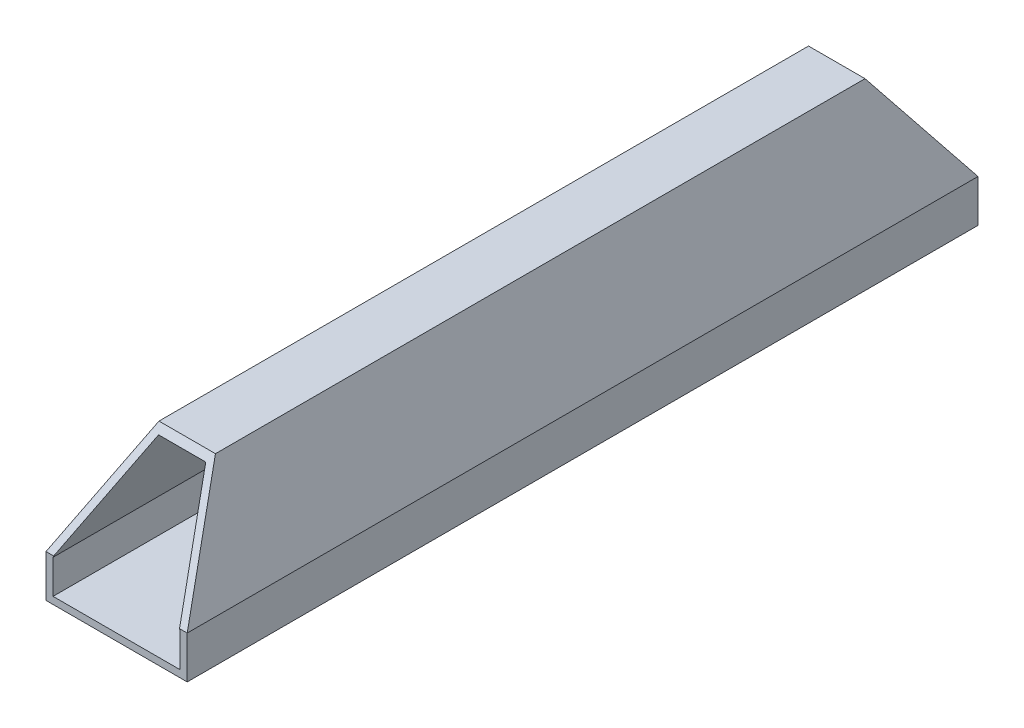
ISO-10303-21;
HEADER;
FILE_DESCRIPTION(('STEP AP214'),'2;1');
FILE_NAME('part.step','',(''),(''),'','','');
FILE_SCHEMA(('AUTOMOTIVE_DESIGN { 1 0 10303 214 1 1 1 1 }'));
ENDSEC;
DATA;
#1=APPLICATION_CONTEXT('core data for automotive mechanical design processes');
#2=APPLICATION_PROTOCOL_DEFINITION('international standard','automotive_design',2000,#1);
#3=PRODUCT_CONTEXT('',#1,'mechanical');
#4=PRODUCT('Part','Part','',(#3));
#5=PRODUCT_RELATED_PRODUCT_CATEGORY('part','',(#4));
#6=PRODUCT_DEFINITION_FORMATION('','',#4);
#7=PRODUCT_DEFINITION_CONTEXT('part definition',#1,'design');
#8=PRODUCT_DEFINITION('design','',#6,#7);
#9=PRODUCT_DEFINITION_SHAPE('','',#8);
#10=(LENGTH_UNIT() NAMED_UNIT(*) SI_UNIT(.MILLI.,.METRE.));
#11=(NAMED_UNIT(*) PLANE_ANGLE_UNIT() SI_UNIT($,.RADIAN.));
#12=(NAMED_UNIT(*) SI_UNIT($,.STERADIAN.) SOLID_ANGLE_UNIT());
#13=UNCERTAINTY_MEASURE_WITH_UNIT(LENGTH_MEASURE(1.E-05),#10,'distance_accuracy_value','');
#14=(GEOMETRIC_REPRESENTATION_CONTEXT(3) GLOBAL_UNCERTAINTY_ASSIGNED_CONTEXT((#13)) GLOBAL_UNIT_ASSIGNED_CONTEXT((#10,
#11,#12)) REPRESENTATION_CONTEXT('',''));
#15=CARTESIAN_POINT('',(0.,0.,0.));
#16=DIRECTION('',(0.,0.,1.));
#17=DIRECTION('',(1.,0.,0.));
#18=AXIS2_PLACEMENT_3D('',#15,#16,#17);
#19=CARTESIAN_POINT('',(-10.,0.,112.));
#20=DIRECTION('',(0.919145030018058,-0.393919298579168,0.));
#21=DIRECTION('',(0.393919298579168,0.919145030018058,0.));
#22=AXIS2_PLACEMENT_3D('',#19,#20,#21);
#23=PLANE('',#22);
#24=DIRECTION('',(0.,0.,-1.));
#25=VECTOR('',#24,1.);
#26=CARTESIAN_POINT('',(-4.,14.,112.));
#27=LINE('',#26,#25);
#28=CARTESIAN_POINT('',(-4.,14.,102.));
#29=VERTEX_POINT('',#28);
#30=CARTESIAN_POINT('',(-4.,14.,10.));
#31=VERTEX_POINT('',#30);
#32=EDGE_CURVE('E189',#29,#31,#27,.T.);
#33=ORIENTED_EDGE('',*,*,#32,.T.);
#34=DIRECTION('',(-0.329292779969071,-0.768349819927832,-0.548821299948452));
#35=VECTOR('',#34,1.);
#36=CARTESIAN_POINT('',(10.2409638554217,47.2289156626506,33.7349397590361));
#37=LINE('',#36,#35);
#38=CARTESIAN_POINT('',(-10.,0.,0.));
#39=VERTEX_POINT('',#38);
#40=EDGE_CURVE('E150',#31,#39,#37,.T.);
#41=ORIENTED_EDGE('',*,*,#40,.T.);
#42=DIRECTION('',(0.,0.,-1.));
#43=VECTOR('',#42,1.);
#44=CARTESIAN_POINT('',(-10.,0.,112.));
#45=LINE('',#44,#43);
#46=CARTESIAN_POINT('',(-10.,0.,112.));
#47=VERTEX_POINT('',#46);
#48=EDGE_CURVE('E196',#47,#39,#45,.T.);
#49=ORIENTED_EDGE('',*,*,#48,.F.);
#50=DIRECTION('',(0.329292779969071,0.768349819927833,-0.548821299948451));
#51=VECTOR('',#50,1.);
#52=CARTESIAN_POINT('',(-10.,0.,112.));
#53=LINE('',#52,#51);
#54=EDGE_CURVE('E219',#47,#29,#53,.T.);
#55=ORIENTED_EDGE('',*,*,#54,.T.);
#56=EDGE_LOOP('',(#33,#41,#49,#55));
#57=FACE_BOUND('',#56,.T.);
#58=ADVANCED_FACE('F39',(#57),#23,.F.);
#59=CARTESIAN_POINT('',(-10.,-6.00000000000001,112.));
#60=DIRECTION('',(1.,0.,0.));
#61=DIRECTION('',(0.,0.,-1.));
#62=AXIS2_PLACEMENT_3D('',#59,#60,#61);
#63=PLANE('',#62);
#64=DIRECTION('',(0.,-1.,0.));
#65=VECTOR('',#64,1.);
#66=CARTESIAN_POINT('',(-10.,-6.00000000000001,0.));
#67=LINE('',#66,#65);
#68=CARTESIAN_POINT('',(-10.,-6.00000000000001,0.));
#69=VERTEX_POINT('',#68);
#70=EDGE_CURVE('E245',#39,#69,#67,.T.);
#71=ORIENTED_EDGE('',*,*,#70,.T.);
#72=DIRECTION('',(0.,0.,-1.));
#73=VECTOR('',#72,1.);
#74=CARTESIAN_POINT('',(-10.,-6.00000000000001,112.));
#75=LINE('',#74,#73);
#76=CARTESIAN_POINT('',(-10.,-6.00000000000001,112.));
#77=VERTEX_POINT('',#76);
#78=EDGE_CURVE('E187',#77,#69,#75,.T.);
#79=ORIENTED_EDGE('',*,*,#78,.F.);
#80=DIRECTION('',(0.,-1.,0.));
#81=VECTOR('',#80,1.);
#82=CARTESIAN_POINT('',(-10.,-6.00000000000001,112.));
#83=LINE('',#82,#81);
#84=EDGE_CURVE('E175',#47,#77,#83,.T.);
#85=ORIENTED_EDGE('',*,*,#84,.F.);
#86=ORIENTED_EDGE('',*,*,#48,.T.);
#87=EDGE_LOOP('',(#71,#79,#85,#86));
#88=FACE_BOUND('',#87,.T.);
#89=ADVANCED_FACE('F337',(#88),#63,.F.);
#90=CARTESIAN_POINT('',(10.,-6.,112.));
#91=DIRECTION('',(0.,1.,0.));
#92=DIRECTION('',(-1.,0.,0.));
#93=AXIS2_PLACEMENT_3D('',#90,#91,#92);
#94=PLANE('',#93);
#95=DIRECTION('',(1.,0.,0.));
#96=VECTOR('',#95,1.);
#97=CARTESIAN_POINT('',(10.,-6.,0.));
#98=LINE('',#97,#96);
#99=CARTESIAN_POINT('',(10.,-6.,0.));
#100=VERTEX_POINT('',#99);
#101=EDGE_CURVE('E176',#69,#100,#98,.T.);
#102=ORIENTED_EDGE('',*,*,#101,.T.);
#103=DIRECTION('',(0.,0.,-1.));
#104=VECTOR('',#103,1.);
#105=CARTESIAN_POINT('',(10.,-6.,112.));
#106=LINE('',#105,#104);
#107=CARTESIAN_POINT('',(10.,-6.,112.));
#108=VERTEX_POINT('',#107);
#109=EDGE_CURVE('E173',#108,#100,#106,.T.);
#110=ORIENTED_EDGE('',*,*,#109,.F.);
#111=DIRECTION('',(1.,0.,0.));
#112=VECTOR('',#111,1.);
#113=CARTESIAN_POINT('',(10.,-6.,112.));
#114=LINE('',#113,#112);
#115=EDGE_CURVE('E262',#77,#108,#114,.T.);
#116=ORIENTED_EDGE('',*,*,#115,.F.);
#117=ORIENTED_EDGE('',*,*,#78,.T.);
#118=EDGE_LOOP('',(#102,#110,#116,#117));
#119=FACE_BOUND('',#118,.T.);
#120=ADVANCED_FACE('F334',(#119),#94,.F.);
#121=CARTESIAN_POINT('',(10.,0.,112.));
#122=DIRECTION('',(-1.,0.,0.));
#123=DIRECTION('',(0.,-1.,0.));
#124=AXIS2_PLACEMENT_3D('',#121,#122,#123);
#125=PLANE('',#124);
#126=DIRECTION('',(0.,1.,0.));
#127=VECTOR('',#126,1.);
#128=CARTESIAN_POINT('',(10.,0.,0.));
#129=LINE('',#128,#127);
#130=CARTESIAN_POINT('',(10.,0.,0.));
#131=VERTEX_POINT('',#130);
#132=EDGE_CURVE('E159',#100,#131,#129,.T.);
#133=ORIENTED_EDGE('',*,*,#132,.T.);
#134=DIRECTION('',(0.,0.,-1.));
#135=VECTOR('',#134,1.);
#136=CARTESIAN_POINT('',(10.,0.,112.));
#137=LINE('',#136,#135);
#138=CARTESIAN_POINT('',(10.,0.,112.));
#139=VERTEX_POINT('',#138);
#140=EDGE_CURVE('E171',#139,#131,#137,.T.);
#141=ORIENTED_EDGE('',*,*,#140,.F.);
#142=DIRECTION('',(0.,1.,0.));
#143=VECTOR('',#142,1.);
#144=CARTESIAN_POINT('',(10.,0.,112.));
#145=LINE('',#144,#143);
#146=EDGE_CURVE('E265',#108,#139,#145,.T.);
#147=ORIENTED_EDGE('',*,*,#146,.F.);
#148=ORIENTED_EDGE('',*,*,#109,.T.);
#149=EDGE_LOOP('',(#133,#141,#147,#148));
#150=FACE_BOUND('',#149,.T.);
#151=ADVANCED_FACE('F169',(#150),#125,.F.);
#152=CARTESIAN_POINT('',(4.,14.,112.));
#153=DIRECTION('',(-0.919145030018058,-0.393919298579168,0.));
#154=DIRECTION('',(0.393919298579168,-0.919145030018058,0.));
#155=AXIS2_PLACEMENT_3D('',#152,#153,#154);
#156=PLANE('',#155);
#157=ORIENTED_EDGE('',*,*,#140,.T.);
#158=DIRECTION('',(-0.329292779969071,0.768349819927832,0.548821299948452));
#159=VECTOR('',#158,1.);
#160=CARTESIAN_POINT('',(-14.433734939759,57.0120481927711,40.7228915662651));
#161=LINE('',#160,#159);
#162=CARTESIAN_POINT('',(4.,14.,10.));
#163=VERTEX_POINT('',#162);
#164=EDGE_CURVE('E138',#131,#163,#161,.T.);
#165=ORIENTED_EDGE('',*,*,#164,.T.);
#166=DIRECTION('',(0.,0.,-1.));
#167=VECTOR('',#166,1.);
#168=CARTESIAN_POINT('',(4.,14.,112.));
#169=LINE('',#168,#167);
#170=CARTESIAN_POINT('',(4.,14.,102.));
#171=VERTEX_POINT('',#170);
#172=EDGE_CURVE('E183',#171,#163,#169,.T.);
#173=ORIENTED_EDGE('',*,*,#172,.F.);
#174=DIRECTION('',(0.329292779969071,-0.768349819927833,0.548821299948452));
#175=VECTOR('',#174,1.);
#176=CARTESIAN_POINT('',(5.80722891566265,9.78313253012048,105.012048192771));
#177=LINE('',#176,#175);
#178=EDGE_CURVE('E180',#171,#139,#177,.T.);
#179=ORIENTED_EDGE('',*,*,#178,.T.);
#180=EDGE_LOOP('',(#157,#165,#173,#179));
#181=FACE_BOUND('',#180,.T.);
#182=ADVANCED_FACE('F179',(#181),#156,.F.);
#183=CARTESIAN_POINT('',(-4.,14.,112.));
#184=DIRECTION('',(0.,-1.,0.));
#185=DIRECTION('',(1.,0.,0.));
#186=AXIS2_PLACEMENT_3D('',#183,#184,#185);
#187=PLANE('',#186);
#188=ORIENTED_EDGE('',*,*,#172,.T.);
#189=DIRECTION('',(-1.,0.,0.));
#190=VECTOR('',#189,1.);
#191=CARTESIAN_POINT('',(10.,14.,10.));
#192=LINE('',#191,#190);
#193=EDGE_CURVE('E144',#163,#31,#192,.T.);
#194=ORIENTED_EDGE('',*,*,#193,.T.);
#195=ORIENTED_EDGE('',*,*,#32,.F.);
#196=DIRECTION('',(1.,0.,0.));
#197=VECTOR('',#196,1.);
#198=CARTESIAN_POINT('',(-10.,14.,102.));
#199=LINE('',#198,#197);
#200=EDGE_CURVE('E281',#29,#171,#199,.T.);
#201=ORIENTED_EDGE('',*,*,#200,.T.);
#202=EDGE_LOOP('',(#188,#194,#195,#201));
#203=FACE_BOUND('',#202,.T.);
#204=ADVANCED_FACE('F280',(#203),#187,.F.);
#205=CARTESIAN_POINT('',(0.,0.,112.));
#206=DIRECTION('',(0.,0.,-1.));
#207=DIRECTION('',(-1.,0.,0.));
#208=AXIS2_PLACEMENT_3D('',#205,#206,#207);
#209=PLANE('',#208);
#210=ORIENTED_EDGE('',*,*,#146,.T.);
#211=DIRECTION('',(1.,0.,0.));
#212=VECTOR('',#211,1.);
#213=CARTESIAN_POINT('',(-10.,0.,112.));
#214=LINE('',#213,#212);
#215=CARTESIAN_POINT('',(8.91203241344801,0.,112.));
#216=VERTEX_POINT('',#215);
#217=EDGE_CURVE('E291',#216,#139,#214,.T.);
#218=ORIENTED_EDGE('',*,*,#217,.F.);
#219=DIRECTION('',(-0.393919298579168,0.919145030018058,0.));
#220=VECTOR('',#219,1.);
#221=CARTESIAN_POINT('',(9.,-0.205257701954643,112.));
#222=LINE('',#221,#220);
#223=CARTESIAN_POINT('',(9.,-0.205257701954643,112.));
#224=VERTEX_POINT('',#223);
#225=EDGE_CURVE('E237',#224,#216,#222,.T.);
#226=ORIENTED_EDGE('',*,*,#225,.F.);
#227=DIRECTION('',(0.,1.,0.));
#228=VECTOR('',#227,1.);
#229=CARTESIAN_POINT('',(9.00000000000001,-5.,112.));
#230=LINE('',#229,#228);
#231=CARTESIAN_POINT('',(9.00000000000001,-5.,112.));
#232=VERTEX_POINT('',#231);
#233=EDGE_CURVE('E233',#232,#224,#230,.T.);
#234=ORIENTED_EDGE('',*,*,#233,.F.);
#235=DIRECTION('',(1.,0.,0.));
#236=VECTOR('',#235,1.);
#237=CARTESIAN_POINT('',(-9.,-5.00000000000001,112.));
#238=LINE('',#237,#236);
#239=CARTESIAN_POINT('',(-9.,-5.00000000000001,112.));
#240=VERTEX_POINT('',#239);
#241=EDGE_CURVE('E223',#240,#232,#238,.T.);
#242=ORIENTED_EDGE('',*,*,#241,.F.);
#243=DIRECTION('',(0.,-1.,0.));
#244=VECTOR('',#243,1.);
#245=CARTESIAN_POINT('',(-9.,-0.205257701954643,112.));
#246=LINE('',#245,#244);
#247=CARTESIAN_POINT('',(-9.,-0.205257701954643,112.));
#248=VERTEX_POINT('',#247);
#249=EDGE_CURVE('E217',#248,#240,#246,.T.);
#250=ORIENTED_EDGE('',*,*,#249,.F.);
#251=DIRECTION('',(-0.393919298579168,-0.919145030018058,0.));
#252=VECTOR('',#251,1.);
#253=CARTESIAN_POINT('',(-3.34060384201944,13.,112.));
#254=LINE('',#253,#252);
#255=CARTESIAN_POINT('',(-8.91203241344801,0.,112.));
#256=VERTEX_POINT('',#255);
#257=EDGE_CURVE('E205',#256,#248,#254,.T.);
#258=ORIENTED_EDGE('',*,*,#257,.F.);
#259=EDGE_CURVE('E61',#47,#256,#214,.T.);
#260=ORIENTED_EDGE('',*,*,#259,.F.);
#261=ORIENTED_EDGE('',*,*,#84,.T.);
#262=ORIENTED_EDGE('',*,*,#115,.T.);
#263=EDGE_LOOP('',(#210,#218,#226,#234,#242,#250,#258,#260,#261,#262));
#264=FACE_BOUND('',#263,.T.);
#265=ADVANCED_FACE('F213',(#264),#209,.F.);
#266=CARTESIAN_POINT('',(0.,0.,0.));
#267=DIRECTION('',(0.,0.,-1.));
#268=DIRECTION('',(-1.,0.,0.));
#269=AXIS2_PLACEMENT_3D('',#266,#267,#268);
#270=PLANE('',#269);
#271=DIRECTION('',(-1.,0.,0.));
#272=VECTOR('',#271,1.);
#273=CARTESIAN_POINT('',(10.,0.,0.));
#274=LINE('',#273,#272);
#275=CARTESIAN_POINT('',(8.91203241344801,0.,0.));
#276=VERTEX_POINT('',#275);
#277=EDGE_CURVE('E141',#131,#276,#274,.T.);
#278=ORIENTED_EDGE('',*,*,#277,.F.);
#279=ORIENTED_EDGE('',*,*,#132,.F.);
#280=ORIENTED_EDGE('',*,*,#101,.F.);
#281=ORIENTED_EDGE('',*,*,#70,.F.);
#282=CARTESIAN_POINT('',(-8.91203241344801,0.,0.));
#283=VERTEX_POINT('',#282);
#284=EDGE_CURVE('E164',#283,#39,#274,.T.);
#285=ORIENTED_EDGE('',*,*,#284,.F.);
#286=DIRECTION('',(-0.393919298579168,-0.919145030018058,0.));
#287=VECTOR('',#286,1.);
#288=CARTESIAN_POINT('',(-3.34060384201944,13.,0.));
#289=LINE('',#288,#287);
#290=CARTESIAN_POINT('',(-9.,-0.205257701954643,0.));
#291=VERTEX_POINT('',#290);
#292=EDGE_CURVE('E241',#283,#291,#289,.T.);
#293=ORIENTED_EDGE('',*,*,#292,.T.);
#294=DIRECTION('',(0.,-1.,0.));
#295=VECTOR('',#294,1.);
#296=CARTESIAN_POINT('',(-9.,-0.205257701954643,0.));
#297=LINE('',#296,#295);
#298=CARTESIAN_POINT('',(-9.,-5.00000000000001,0.));
#299=VERTEX_POINT('',#298);
#300=EDGE_CURVE('E307',#291,#299,#297,.T.);
#301=ORIENTED_EDGE('',*,*,#300,.T.);
#302=DIRECTION('',(1.,0.,0.));
#303=VECTOR('',#302,1.);
#304=CARTESIAN_POINT('',(-9.,-5.00000000000001,0.));
#305=LINE('',#304,#303);
#306=CARTESIAN_POINT('',(9.00000000000001,-5.,0.));
#307=VERTEX_POINT('',#306);
#308=EDGE_CURVE('E311',#299,#307,#305,.T.);
#309=ORIENTED_EDGE('',*,*,#308,.T.);
#310=DIRECTION('',(0.,1.,0.));
#311=VECTOR('',#310,1.);
#312=CARTESIAN_POINT('',(9.00000000000001,-5.,0.));
#313=LINE('',#312,#311);
#314=CARTESIAN_POINT('',(9.,-0.205257701954643,0.));
#315=VERTEX_POINT('',#314);
#316=EDGE_CURVE('E314',#307,#315,#313,.T.);
#317=ORIENTED_EDGE('',*,*,#316,.T.);
#318=DIRECTION('',(-0.393919298579168,0.919145030018058,0.));
#319=VECTOR('',#318,1.);
#320=CARTESIAN_POINT('',(9.,-0.205257701954643,0.));
#321=LINE('',#320,#319);
#322=EDGE_CURVE('E162',#315,#276,#321,.T.);
#323=ORIENTED_EDGE('',*,*,#322,.T.);
#324=EDGE_LOOP('',(#278,#279,#280,#281,#285,#293,#301,#309,#317,#323));
#325=FACE_BOUND('',#324,.T.);
#326=ADVANCED_FACE('F157',(#325),#270,.T.);
#327=CARTESIAN_POINT('',(3.34060384201944,13.,0.));
#328=DIRECTION('',(0.,1.,0.));
#329=DIRECTION('',(-1.,0.,0.));
#330=AXIS2_PLACEMENT_3D('',#327,#328,#329);
#331=PLANE('',#330);
#332=DIRECTION('',(0.,0.,1.));
#333=VECTOR('',#332,1.);
#334=CARTESIAN_POINT('',(-3.34060384201944,13.,0.));
#335=LINE('',#334,#333);
#336=CARTESIAN_POINT('',(-3.34060384201944,13.,9.28571428571429));
#337=VERTEX_POINT('',#336);
#338=CARTESIAN_POINT('',(-3.34060384201944,13.,102.714285714286));
#339=VERTEX_POINT('',#338);
#340=EDGE_CURVE('E208',#337,#339,#335,.T.);
#341=ORIENTED_EDGE('',*,*,#340,.F.);
#342=DIRECTION('',(1.,0.,0.));
#343=VECTOR('',#342,1.);
#344=CARTESIAN_POINT('',(3.34060384201944,13.,9.28571428571429));
#345=LINE('',#344,#343);
#346=CARTESIAN_POINT('',(3.34060384201944,13.,9.28571428571429));
#347=VERTEX_POINT('',#346);
#348=EDGE_CURVE('E54',#337,#347,#345,.T.);
#349=ORIENTED_EDGE('',*,*,#348,.T.);
#350=DIRECTION('',(0.,0.,1.));
#351=VECTOR('',#350,1.);
#352=CARTESIAN_POINT('',(3.34060384201944,13.,0.));
#353=LINE('',#352,#351);
#354=CARTESIAN_POINT('',(3.34060384201944,13.,102.714285714286));
#355=VERTEX_POINT('',#354);
#356=EDGE_CURVE('E242',#347,#355,#353,.T.);
#357=ORIENTED_EDGE('',*,*,#356,.T.);
#358=DIRECTION('',(-1.,0.,0.));
#359=VECTOR('',#358,1.);
#360=CARTESIAN_POINT('',(3.34060384201942,13.,102.714285714286));
#361=LINE('',#360,#359);
#362=EDGE_CURVE('E294',#355,#339,#361,.T.);
#363=ORIENTED_EDGE('',*,*,#362,.T.);
#364=EDGE_LOOP('',(#341,#349,#357,#363));
#365=FACE_BOUND('',#364,.T.);
#366=ADVANCED_FACE('F327',(#365),#331,.F.);
#367=CARTESIAN_POINT('',(9.,-0.205257701954643,0.));
#368=DIRECTION('',(0.919145030018058,0.393919298579168,0.));
#369=DIRECTION('',(-0.393919298579168,0.919145030018058,0.));
#370=AXIS2_PLACEMENT_3D('',#367,#368,#369);
#371=PLANE('',#370);
#372=ORIENTED_EDGE('',*,*,#356,.F.);
#373=DIRECTION('',(0.329292779969071,-0.768349819927832,-0.548821299948452));
#374=VECTOR('',#373,1.);
#375=CARTESIAN_POINT('',(8.97350373899037,-0.143433092932163,-0.102452209237254));
#376=LINE('',#375,#374);
#377=EDGE_CURVE('E151',#347,#276,#376,.T.);
#378=ORIENTED_EDGE('',*,*,#377,.T.);
#379=ORIENTED_EDGE('',*,*,#322,.F.);
#380=DIRECTION('',(0.,0.,1.));
#381=VECTOR('',#380,1.);
#382=CARTESIAN_POINT('',(9.,-0.205257701954643,0.));
#383=LINE('',#382,#381);
#384=EDGE_CURVE('E246',#315,#224,#383,.T.);
#385=ORIENTED_EDGE('',*,*,#384,.T.);
#386=ORIENTED_EDGE('',*,*,#225,.T.);
#387=DIRECTION('',(-0.329292779969071,0.768349819927833,-0.548821299948452));
#388=VECTOR('',#387,1.);
#389=CARTESIAN_POINT('',(-11.2674601164313,47.0854825697184,78.3675124502011));
#390=LINE('',#389,#388);
#391=EDGE_CURVE('E299',#216,#355,#390,.T.);
#392=ORIENTED_EDGE('',*,*,#391,.T.);
#393=EDGE_LOOP('',(#372,#378,#379,#385,#386,#392));
#394=FACE_BOUND('',#393,.T.);
#395=ADVANCED_FACE('F325',(#394),#371,.F.);
#396=CARTESIAN_POINT('',(9.00000000000001,-5.,0.));
#397=DIRECTION('',(1.,0.,0.));
#398=DIRECTION('',(0.,1.,0.));
#399=AXIS2_PLACEMENT_3D('',#396,#397,#398);
#400=PLANE('',#399);
#401=ORIENTED_EDGE('',*,*,#233,.T.);
#402=ORIENTED_EDGE('',*,*,#384,.F.);
#403=ORIENTED_EDGE('',*,*,#316,.F.);
#404=DIRECTION('',(0.,0.,1.));
#405=VECTOR('',#404,1.);
#406=CARTESIAN_POINT('',(9.00000000000001,-5.,0.));
#407=LINE('',#406,#405);
#408=EDGE_CURVE('E249',#307,#232,#407,.T.);
#409=ORIENTED_EDGE('',*,*,#408,.T.);
#410=EDGE_LOOP('',(#401,#402,#403,#409));
#411=FACE_BOUND('',#410,.T.);
#412=ADVANCED_FACE('F320',(#411),#400,.F.);
#413=CARTESIAN_POINT('',(-9.,-5.00000000000001,0.));
#414=DIRECTION('',(0.,-1.,0.));
#415=DIRECTION('',(1.,0.,0.));
#416=AXIS2_PLACEMENT_3D('',#413,#414,#415);
#417=PLANE('',#416);
#418=ORIENTED_EDGE('',*,*,#241,.T.);
#419=ORIENTED_EDGE('',*,*,#408,.F.);
#420=ORIENTED_EDGE('',*,*,#308,.F.);
#421=DIRECTION('',(0.,0.,1.));
#422=VECTOR('',#421,1.);
#423=CARTESIAN_POINT('',(-9.,-5.00000000000001,0.));
#424=LINE('',#423,#422);
#425=EDGE_CURVE('E252',#299,#240,#424,.T.);
#426=ORIENTED_EDGE('',*,*,#425,.T.);
#427=EDGE_LOOP('',(#418,#419,#420,#426));
#428=FACE_BOUND('',#427,.T.);
#429=ADVANCED_FACE('F362',(#428),#417,.F.);
#430=CARTESIAN_POINT('',(-9.,-0.205257701954643,0.));
#431=DIRECTION('',(-1.,0.,0.));
#432=DIRECTION('',(0.,0.,1.));
#433=AXIS2_PLACEMENT_3D('',#430,#431,#432);
#434=PLANE('',#433);
#435=ORIENTED_EDGE('',*,*,#249,.T.);
#436=ORIENTED_EDGE('',*,*,#425,.F.);
#437=ORIENTED_EDGE('',*,*,#300,.F.);
#438=DIRECTION('',(0.,0.,1.));
#439=VECTOR('',#438,1.);
#440=CARTESIAN_POINT('',(-9.,-0.205257701954643,0.));
#441=LINE('',#440,#439);
#442=EDGE_CURVE('E255',#291,#248,#441,.T.);
#443=ORIENTED_EDGE('',*,*,#442,.T.);
#444=EDGE_LOOP('',(#435,#436,#437,#443));
#445=FACE_BOUND('',#444,.T.);
#446=ADVANCED_FACE('F359',(#445),#434,.F.);
#447=CARTESIAN_POINT('',(-3.34060384201944,13.,0.));
#448=DIRECTION('',(-0.919145030018058,0.393919298579168,0.));
#449=DIRECTION('',(-0.393919298579168,-0.919145030018058,0.));
#450=AXIS2_PLACEMENT_3D('',#447,#448,#449);
#451=PLANE('',#450);
#452=ORIENTED_EDGE('',*,*,#292,.F.);
#453=DIRECTION('',(0.329292779969071,0.768349819927832,0.548821299948452));
#454=VECTOR('',#453,1.);
#455=CARTESIAN_POINT('',(-5.0187449779919,9.08433734939758,6.48881239242685));
#456=LINE('',#455,#454);
#457=EDGE_CURVE('E11',#283,#337,#456,.T.);
#458=ORIENTED_EDGE('',*,*,#457,.T.);
#459=ORIENTED_EDGE('',*,*,#340,.T.);
#460=DIRECTION('',(-0.329292779969071,-0.768349819927833,0.548821299948451));
#461=VECTOR('',#460,1.);
#462=CARTESIAN_POINT('',(15.2222188774298,56.3132530120482,71.7762478485371));
#463=LINE('',#462,#461);
#464=EDGE_CURVE('E47',#339,#256,#463,.T.);
#465=ORIENTED_EDGE('',*,*,#464,.T.);
#466=ORIENTED_EDGE('',*,*,#257,.T.);
#467=ORIENTED_EDGE('',*,*,#442,.F.);
#468=EDGE_LOOP('',(#452,#458,#459,#465,#466,#467));
#469=FACE_BOUND('',#468,.T.);
#470=ADVANCED_FACE('F203',(#469),#451,.F.);
#471=CARTESIAN_POINT('',(-10.,14.,102.));
#472=DIRECTION('',(0.,-0.581238193719096,-0.813733471206735));
#473=DIRECTION('',(0.,0.813733471206735,-0.581238193719096));
#474=AXIS2_PLACEMENT_3D('',#471,#472,#473);
#475=PLANE('',#474);
#476=ORIENTED_EDGE('',*,*,#259,.T.);
#477=ORIENTED_EDGE('',*,*,#464,.F.);
#478=ORIENTED_EDGE('',*,*,#362,.F.);
#479=ORIENTED_EDGE('',*,*,#391,.F.);
#480=ORIENTED_EDGE('',*,*,#217,.T.);
#481=ORIENTED_EDGE('',*,*,#178,.F.);
#482=ORIENTED_EDGE('',*,*,#200,.F.);
#483=ORIENTED_EDGE('',*,*,#54,.F.);
#484=EDGE_LOOP('',(#476,#477,#478,#479,#480,#481,#482,#483));
#485=FACE_BOUND('',#484,.T.);
#486=ADVANCED_FACE('F328',(#485),#475,.F.);
#487=CARTESIAN_POINT('',(10.,14.,10.));
#488=DIRECTION('',(0.,-0.581238193719096,0.813733471206735));
#489=DIRECTION('',(0.,-0.813733471206735,-0.581238193719096));
#490=AXIS2_PLACEMENT_3D('',#487,#488,#489);
#491=PLANE('',#490);
#492=ORIENTED_EDGE('',*,*,#193,.F.);
#493=ORIENTED_EDGE('',*,*,#164,.F.);
#494=ORIENTED_EDGE('',*,*,#277,.T.);
#495=ORIENTED_EDGE('',*,*,#377,.F.);
#496=ORIENTED_EDGE('',*,*,#348,.F.);
#497=ORIENTED_EDGE('',*,*,#457,.F.);
#498=ORIENTED_EDGE('',*,*,#284,.T.);
#499=ORIENTED_EDGE('',*,*,#40,.F.);
#500=EDGE_LOOP('',(#492,#493,#494,#495,#496,#497,#498,#499));
#501=FACE_BOUND('',#500,.T.);
#502=ADVANCED_FACE('F140',(#501),#491,.F.);
#503=CLOSED_SHELL('',(#58,#89,#120,#151,#182,#204,#265,#326,#366,#395,#412,#429,#446,#470,#486,#502));
#504=MANIFOLD_SOLID_BREP('B2',#503);
#505=ADVANCED_BREP_SHAPE_REPRESENTATION('',(#18,#504),#14);
#506=SHAPE_DEFINITION_REPRESENTATION(#9,#505);
ENDSEC;
END-ISO-10303-21;
